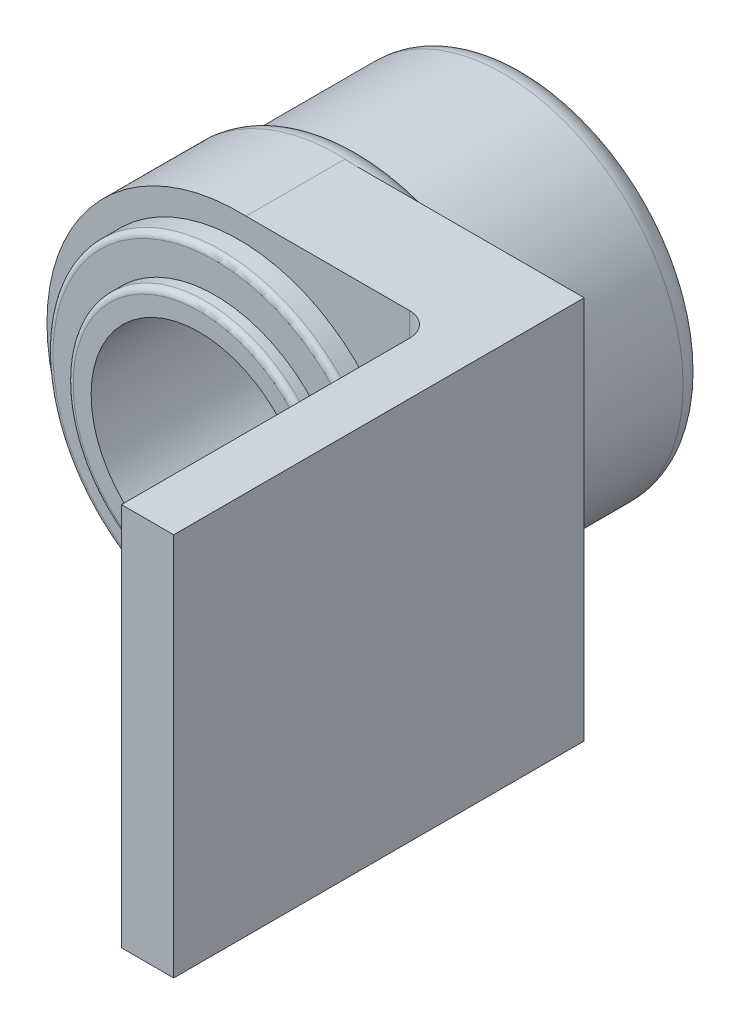
ISO-10303-21;
HEADER;
FILE_DESCRIPTION(('STEP AP214'),'2;1');
FILE_NAME('part.step','',(''),(''),'','','');
FILE_SCHEMA(('AUTOMOTIVE_DESIGN { 1 0 10303 214 1 1 1 1 }'));
ENDSEC;
DATA;
#1=APPLICATION_CONTEXT('core data for automotive mechanical design processes');
#2=APPLICATION_PROTOCOL_DEFINITION('international standard','automotive_design',2000,#1);
#3=PRODUCT_CONTEXT('',#1,'mechanical');
#4=PRODUCT('Part','Part','',(#3));
#5=PRODUCT_RELATED_PRODUCT_CATEGORY('part','',(#4));
#6=PRODUCT_DEFINITION_FORMATION('','',#4);
#7=PRODUCT_DEFINITION_CONTEXT('part definition',#1,'design');
#8=PRODUCT_DEFINITION('design','',#6,#7);
#9=PRODUCT_DEFINITION_SHAPE('','',#8);
#10=(LENGTH_UNIT() NAMED_UNIT(*) SI_UNIT(.MILLI.,.METRE.));
#11=(NAMED_UNIT(*) PLANE_ANGLE_UNIT() SI_UNIT($,.RADIAN.));
#12=(NAMED_UNIT(*) SI_UNIT($,.STERADIAN.) SOLID_ANGLE_UNIT());
#13=UNCERTAINTY_MEASURE_WITH_UNIT(LENGTH_MEASURE(1.E-05),#10,'distance_accuracy_value','');
#14=(GEOMETRIC_REPRESENTATION_CONTEXT(3) GLOBAL_UNCERTAINTY_ASSIGNED_CONTEXT((#13)) GLOBAL_UNIT_ASSIGNED_CONTEXT((#10,
#11,#12)) REPRESENTATION_CONTEXT('',''));
#15=CARTESIAN_POINT('',(0.,0.,0.));
#16=DIRECTION('',(0.,0.,1.));
#17=DIRECTION('',(1.,0.,0.));
#18=AXIS2_PLACEMENT_3D('',#15,#16,#17);
#19=CARTESIAN_POINT('',(0.,0.,30.48));
#20=DIRECTION('',(0.,0.,1.));
#21=DIRECTION('',(1.,0.,0.));
#22=AXIS2_PLACEMENT_3D('',#19,#20,#21);
#23=PLANE('',#22);
#24=CARTESIAN_POINT('',(0.,0.,30.48));
#25=DIRECTION('',(0.,0.,1.));
#26=DIRECTION('',(1.,0.,0.));
#27=AXIS2_PLACEMENT_3D('',#24,#25,#26);
#28=CIRCLE('',#27,17.78);
#29=CARTESIAN_POINT('',(17.78,0.,30.48));
#30=VERTEX_POINT('',#29);
#31=EDGE_CURVE('E178',#30,#30,#28,.T.);
#32=ORIENTED_EDGE('',*,*,#31,.F.);
#33=EDGE_LOOP('',(#32));
#34=FACE_BOUND('',#33,.T.);
#35=DIRECTION('',(1.,0.,0.));
#36=VECTOR('',#35,1.);
#37=CARTESIAN_POINT('',(0.711033109642091,-20.307556030133,30.48));
#38=LINE('',#37,#36);
#39=CARTESIAN_POINT('',(0.711033109642091,-20.307556030133,30.48));
#40=VERTEX_POINT('',#39);
#41=CARTESIAN_POINT('',(18.0405418442311,-20.307556030133,30.48));
#42=VERTEX_POINT('',#41);
#43=EDGE_CURVE('E180',#40,#42,#38,.T.);
#44=ORIENTED_EDGE('',*,*,#43,.T.);
#45=DIRECTION('',(0.,-1.,0.));
#46=VECTOR('',#45,1.);
#47=CARTESIAN_POINT('',(18.0405418442311,0.,30.48));
#48=LINE('',#47,#46);
#49=CARTESIAN_POINT('',(18.0405418442311,20.3063824496731,30.48));
#50=VERTEX_POINT('',#49);
#51=EDGE_CURVE('E60',#42,#50,#48,.F.);
#52=ORIENTED_EDGE('',*,*,#51,.T.);
#53=DIRECTION('',(-1.,0.,0.));
#54=VECTOR('',#53,1.);
#55=CARTESIAN_POINT('',(26.1110331096421,20.3063824496731,30.48));
#56=LINE('',#55,#54);
#57=CARTESIAN_POINT('',(0.743795541535241,20.3063824496731,30.48));
#58=VERTEX_POINT('',#57);
#59=EDGE_CURVE('E79',#50,#58,#56,.T.);
#60=ORIENTED_EDGE('',*,*,#59,.T.);
#61=CARTESIAN_POINT('',(0.,0.,30.48));
#62=DIRECTION('',(0.,0.,1.));
#63=DIRECTION('',(1.,0.,0.));
#64=AXIS2_PLACEMENT_3D('',#61,#62,#63);
#65=CIRCLE('',#64,20.32);
#66=EDGE_CURVE('E121',#58,#40,#65,.T.);
#67=ORIENTED_EDGE('',*,*,#66,.T.);
#68=EDGE_LOOP('',(#44,#52,#60,#67));
#69=FACE_BOUND('',#68,.T.);
#70=ADVANCED_FACE('F35',(#34,#69),#23,.T.);
#71=CARTESIAN_POINT('',(0.,0.,17.78));
#72=DIRECTION('',(0.,0.,-1.));
#73=DIRECTION('',(-1.,0.,0.));
#74=AXIS2_PLACEMENT_3D('',#71,#72,#73);
#75=CYLINDRICAL_SURFACE('',#74,19.05);
#76=CARTESIAN_POINT('',(0.,0.,2.54));
#77=DIRECTION('',(0.,0.,1.));
#78=DIRECTION('',(1.,0.,0.));
#79=AXIS2_PLACEMENT_3D('',#76,#77,#78);
#80=CIRCLE('',#79,19.05);
#81=CARTESIAN_POINT('',(19.05,0.,2.54));
#82=VERTEX_POINT('',#81);
#83=EDGE_CURVE('E233',#82,#82,#80,.T.);
#84=ORIENTED_EDGE('',*,*,#83,.T.);
#85=EDGE_LOOP('',(#84));
#86=FACE_BOUND('',#85,.T.);
#87=CARTESIAN_POINT('',(0.,0.,17.78));
#88=DIRECTION('',(0.,0.,1.));
#89=DIRECTION('',(1.,0.,0.));
#90=AXIS2_PLACEMENT_3D('',#87,#88,#89);
#91=CIRCLE('',#90,19.05);
#92=CARTESIAN_POINT('',(19.05,0.,17.78));
#93=VERTEX_POINT('',#92);
#94=EDGE_CURVE('E227',#93,#93,#91,.T.);
#95=ORIENTED_EDGE('',*,*,#94,.F.);
#96=EDGE_LOOP('',(#95));
#97=FACE_BOUND('',#96,.T.);
#98=ADVANCED_FACE('F140',(#86,#97),#75,.T.);
#99=CARTESIAN_POINT('',(0.,0.,0.));
#100=DIRECTION('',(0.,0.,1.));
#101=DIRECTION('',(1.,0.,0.));
#102=AXIS2_PLACEMENT_3D('',#99,#100,#101);
#103=PLANE('',#102);
#104=CARTESIAN_POINT('',(0.,0.,0.));
#105=DIRECTION('',(0.,0.,1.));
#106=DIRECTION('',(1.,0.,0.));
#107=AXIS2_PLACEMENT_3D('',#104,#105,#106);
#108=CIRCLE('',#107,16.51);
#109=CARTESIAN_POINT('',(16.51,0.,0.));
#110=VERTEX_POINT('',#109);
#111=EDGE_CURVE('E236',#110,#110,#108,.F.);
#112=ORIENTED_EDGE('',*,*,#111,.T.);
#113=EDGE_LOOP('',(#112));
#114=FACE_BOUND('',#113,.T.);
#115=CARTESIAN_POINT('',(0.,0.,0.));
#116=DIRECTION('',(0.,0.,1.));
#117=DIRECTION('',(1.,0.,0.));
#118=AXIS2_PLACEMENT_3D('',#115,#116,#117);
#119=CIRCLE('',#118,12.3597045256125);
#120=CARTESIAN_POINT('',(12.3597045256125,0.,0.));
#121=VERTEX_POINT('',#120);
#122=EDGE_CURVE('E230',#121,#121,#119,.T.);
#123=ORIENTED_EDGE('',*,*,#122,.T.);
#124=EDGE_LOOP('',(#123));
#125=FACE_BOUND('',#124,.T.);
#126=ADVANCED_FACE('F136',(#114,#125),#103,.F.);
#127=CARTESIAN_POINT('',(0.,0.,1.27));
#128=DIRECTION('',(0.,0.,-1.));
#129=DIRECTION('',(-1.,0.,0.));
#130=AXIS2_PLACEMENT_3D('',#127,#128,#129);
#131=PLANE('',#130);
#132=CARTESIAN_POINT('',(0.,0.,1.27));
#133=DIRECTION('',(0.,0.,-1.));
#134=DIRECTION('',(-1.,0.,0.));
#135=AXIS2_PLACEMENT_3D('',#132,#133,#134);
#136=CIRCLE('',#135,10.16);
#137=CARTESIAN_POINT('',(-10.16,0.,1.27));
#138=VERTEX_POINT('',#137);
#139=EDGE_CURVE('E224',#138,#138,#136,.T.);
#140=ORIENTED_EDGE('',*,*,#139,.T.);
#141=EDGE_LOOP('',(#140));
#142=FACE_BOUND('',#141,.T.);
#143=ADVANCED_FACE('F132',(#142),#131,.T.);
#144=CARTESIAN_POINT('',(0.,0.,2.54));
#145=DIRECTION('',(0.,0.,1.));
#146=DIRECTION('',(1.,0.,0.));
#147=AXIS2_PLACEMENT_3D('',#144,#145,#146);
#148=TOROIDAL_SURFACE('',#147,12.3597045256125,2.54);
#149=ORIENTED_EDGE('',*,*,#122,.F.);
#150=EDGE_LOOP('',(#149));
#151=FACE_BOUND('',#150,.T.);
#152=ORIENTED_EDGE('',*,*,#139,.F.);
#153=EDGE_LOOP('',(#152));
#154=FACE_BOUND('',#153,.T.);
#155=ADVANCED_FACE('F135',(#151,#154),#148,.T.);
#156=CARTESIAN_POINT('',(0.,0.,2.54));
#157=DIRECTION('',(0.,0.,1.));
#158=DIRECTION('',(1.,0.,0.));
#159=AXIS2_PLACEMENT_3D('',#156,#157,#158);
#160=TOROIDAL_SURFACE('',#159,16.51,2.54);
#161=ORIENTED_EDGE('',*,*,#111,.F.);
#162=EDGE_LOOP('',(#161));
#163=FACE_BOUND('',#162,.T.);
#164=ORIENTED_EDGE('',*,*,#83,.F.);
#165=EDGE_LOOP('',(#164));
#166=FACE_BOUND('',#165,.T.);
#167=ADVANCED_FACE('F129',(#163,#166),#160,.T.);
#168=CARTESIAN_POINT('',(0.,0.,30.48));
#169=DIRECTION('',(0.,0.,-1.));
#170=DIRECTION('',(-1.,0.,0.));
#171=AXIS2_PLACEMENT_3D('',#168,#169,#170);
#172=CYLINDRICAL_SURFACE('',#171,20.32);
#173=CARTESIAN_POINT('',(0.,0.,20.066));
#174=DIRECTION('',(0.,0.,-1.));
#175=DIRECTION('',(-1.,0.,0.));
#176=AXIS2_PLACEMENT_3D('',#173,#174,#175);
#177=CIRCLE('',#176,20.32);
#178=CARTESIAN_POINT('',(0.743795541535204,20.3063824496731,20.066));
#179=VERTEX_POINT('',#178);
#180=CARTESIAN_POINT('',(20.315186875558,-0.442246776307828,20.066));
#181=VERTEX_POINT('',#180);
#182=EDGE_CURVE('E107',#179,#181,#177,.T.);
#183=ORIENTED_EDGE('',*,*,#182,.T.);
#184=DIRECTION('',(0.,0.,1.));
#185=VECTOR('',#184,1.);
#186=CARTESIAN_POINT('',(20.315186875558,-0.442246776307828,20.066));
#187=LINE('',#186,#185);
#188=CARTESIAN_POINT('',(20.315186875558,-0.442246776307828,31.889694739701));
#189=VERTEX_POINT('',#188);
#190=EDGE_CURVE('E209',#181,#189,#187,.T.);
#191=ORIENTED_EDGE('',*,*,#190,.T.);
#192=CARTESIAN_POINT('',(20.196745768736,-2.23469468899993,31.6774708062952));
#193=CARTESIAN_POINT('',(20.2130972578753,-2.0869078589941,31.7037217129536));
#194=CARTESIAN_POINT('',(20.2278590378379,-1.93865722935699,31.728510658331));
#195=CARTESIAN_POINT('',(20.2541376364174,-1.64150272376683,31.7740960102462));
#196=CARTESIAN_POINT('',(20.2656595278468,-1.49260024394653,31.7948986418478));
#197=CARTESIAN_POINT('',(20.2854456849002,-1.19393395859893,31.8315339621637));
#198=CARTESIAN_POINT('',(20.2937095843895,-1.04417005818251,31.84736609225));
#199=CARTESIAN_POINT('',(20.3069419062212,-0.743761340839121,31.8731712969486));
#200=CARTESIAN_POINT('',(20.3119051220306,-0.593115508512003,31.8831351120013));
#201=CARTESIAN_POINT('',(20.315186875558,-0.442246776307825,31.889694739701));
#202=B_SPLINE_CURVE_WITH_KNOTS('',3,(#192,#193,#194,#195,#196,#197,#198,#199,#200,#201),
.UNSPECIFIED.,.F.,.F.,(4,2,2,2,4),(0.,0.452989463499388,0.905265664490273,1.35759267800912,
1.81063151511252),.UNSPECIFIED.);
#203=CARTESIAN_POINT('',(20.196745768736,-2.23469468899993,31.6774708062952));
#204=VERTEX_POINT('',#203);
#205=EDGE_CURVE('E115',#204,#189,#202,.T.);
#206=ORIENTED_EDGE('',*,*,#205,.F.);
#207=DIRECTION('',(0.,0.,1.));
#208=VECTOR('',#207,1.);
#209=CARTESIAN_POINT('',(20.196745768736,-2.23469468899993,20.066));
#210=LINE('',#209,#208);
#211=CARTESIAN_POINT('',(20.196745768736,-2.23469468899993,20.066));
#212=VERTEX_POINT('',#211);
#213=EDGE_CURVE('E198',#204,#212,#210,.F.);
#214=ORIENTED_EDGE('',*,*,#213,.T.);
#215=CARTESIAN_POINT('',(0.711033109642091,-20.307556030133,20.066));
#216=VERTEX_POINT('',#215);
#217=EDGE_CURVE('E111',#212,#216,#177,.T.);
#218=ORIENTED_EDGE('',*,*,#217,.T.);
#219=DIRECTION('',(0.,0.,1.));
#220=VECTOR('',#219,1.);
#221=CARTESIAN_POINT('',(0.711033109642091,-20.307556030133,20.066));
#222=LINE('',#221,#220);
#223=EDGE_CURVE('E205',#216,#40,#222,.T.);
#224=ORIENTED_EDGE('',*,*,#223,.T.);
#225=ORIENTED_EDGE('',*,*,#66,.F.);
#226=DIRECTION('',(0.,0.,1.));
#227=VECTOR('',#226,1.);
#228=CARTESIAN_POINT('',(0.743795541535204,20.3063824496731,20.066));
#229=LINE('',#228,#227);
#230=EDGE_CURVE('E196',#179,#58,#229,.T.);
#231=ORIENTED_EDGE('',*,*,#230,.F.);
#232=EDGE_LOOP('',(#183,#191,#206,#214,#218,#224,#225,#231));
#233=FACE_BOUND('',#232,.T.);
#234=CARTESIAN_POINT('',(0.,0.,19.9797045256125));
#235=DIRECTION('',(0.,0.,-1.));
#236=DIRECTION('',(-1.,0.,0.));
#237=AXIS2_PLACEMENT_3D('',#234,#235,#236);
#238=CIRCLE('',#237,20.32);
#239=CARTESIAN_POINT('',(-20.32,0.,19.9797045256125));
#240=VERTEX_POINT('',#239);
#241=EDGE_CURVE('E222',#240,#240,#238,.F.);
#242=ORIENTED_EDGE('',*,*,#241,.T.);
#243=EDGE_LOOP('',(#242));
#244=FACE_BOUND('',#243,.T.);
#245=ADVANCED_FACE('F123',(#233,#244),#172,.T.);
#246=CARTESIAN_POINT('',(0.,0.,19.9797045256125));
#247=DIRECTION('',(0.,0.,-1.));
#248=DIRECTION('',(-1.,0.,0.));
#249=AXIS2_PLACEMENT_3D('',#246,#247,#248);
#250=TOROIDAL_SURFACE('',#249,17.78,2.54);
#251=ORIENTED_EDGE('',*,*,#94,.T.);
#252=EDGE_LOOP('',(#251));
#253=FACE_BOUND('',#252,.T.);
#254=ORIENTED_EDGE('',*,*,#241,.F.);
#255=EDGE_LOOP('',(#254));
#256=FACE_BOUND('',#255,.T.);
#257=ADVANCED_FACE('F128',(#253,#256),#250,.T.);
#258=CARTESIAN_POINT('',(0.,0.,33.02));
#259=DIRECTION('',(0.,0.,-1.));
#260=DIRECTION('',(-1.,0.,0.));
#261=AXIS2_PLACEMENT_3D('',#258,#259,#260);
#262=CYLINDRICAL_SURFACE('',#261,17.78);
#263=CARTESIAN_POINT('',(0.,0.,32.385));
#264=DIRECTION('',(0.,0.,1.));
#265=DIRECTION('',(1.,0.,0.));
#266=AXIS2_PLACEMENT_3D('',#263,#264,#265);
#267=CIRCLE('',#266,17.78);
#268=CARTESIAN_POINT('',(17.78,0.,32.385));
#269=VERTEX_POINT('',#268);
#270=EDGE_CURVE('E248',#269,#269,#267,.F.);
#271=ORIENTED_EDGE('',*,*,#270,.T.);
#272=EDGE_LOOP('',(#271));
#273=FACE_BOUND('',#272,.T.);
#274=ORIENTED_EDGE('',*,*,#31,.T.);
#275=EDGE_LOOP('',(#274));
#276=FACE_BOUND('',#275,.T.);
#277=ADVANCED_FACE('F153',(#273,#276),#262,.T.);
#278=CARTESIAN_POINT('',(0.,0.,33.02));
#279=DIRECTION('',(0.,0.,1.));
#280=DIRECTION('',(1.,0.,0.));
#281=AXIS2_PLACEMENT_3D('',#278,#279,#280);
#282=PLANE('',#281);
#283=CARTESIAN_POINT('',(0.,0.,33.02));
#284=DIRECTION('',(0.,0.,1.));
#285=DIRECTION('',(1.,0.,0.));
#286=AXIS2_PLACEMENT_3D('',#283,#284,#285);
#287=CIRCLE('',#286,17.145);
#288=CARTESIAN_POINT('',(17.145,0.,33.02));
#289=VERTEX_POINT('',#288);
#290=EDGE_CURVE('E246',#289,#289,#287,.T.);
#291=ORIENTED_EDGE('',*,*,#290,.T.);
#292=EDGE_LOOP('',(#291));
#293=FACE_BOUND('',#292,.T.);
#294=CARTESIAN_POINT('',(0.,0.,33.02));
#295=DIRECTION('',(0.,0.,1.));
#296=DIRECTION('',(1.,0.,0.));
#297=AXIS2_PLACEMENT_3D('',#294,#295,#296);
#298=CIRCLE('',#297,13.97);
#299=CARTESIAN_POINT('',(13.97,0.,33.02));
#300=VERTEX_POINT('',#299);
#301=EDGE_CURVE('E217',#300,#300,#298,.T.);
#302=ORIENTED_EDGE('',*,*,#301,.F.);
#303=EDGE_LOOP('',(#302));
#304=FACE_BOUND('',#303,.T.);
#305=ADVANCED_FACE('F334',(#293,#304),#282,.T.);
#306=CARTESIAN_POINT('',(0.,0.,34.6964));
#307=DIRECTION('',(0.,0.,-1.));
#308=DIRECTION('',(-1.,0.,0.));
#309=AXIS2_PLACEMENT_3D('',#306,#307,#308);
#310=CYLINDRICAL_SURFACE('',#309,13.97);
#311=CARTESIAN_POINT('',(0.,0.,34.0614));
#312=DIRECTION('',(0.,0.,1.));
#313=DIRECTION('',(1.,0.,0.));
#314=AXIS2_PLACEMENT_3D('',#311,#312,#313);
#315=CIRCLE('',#314,13.97);
#316=CARTESIAN_POINT('',(13.97,0.,34.0614));
#317=VERTEX_POINT('',#316);
#318=EDGE_CURVE('E243',#317,#317,#315,.F.);
#319=ORIENTED_EDGE('',*,*,#318,.T.);
#320=EDGE_LOOP('',(#319));
#321=FACE_BOUND('',#320,.T.);
#322=ORIENTED_EDGE('',*,*,#301,.T.);
#323=EDGE_LOOP('',(#322));
#324=FACE_BOUND('',#323,.T.);
#325=ADVANCED_FACE('F330',(#321,#324),#310,.T.);
#326=CARTESIAN_POINT('',(0.,0.,34.6964));
#327=DIRECTION('',(0.,0.,1.));
#328=DIRECTION('',(1.,0.,0.));
#329=AXIS2_PLACEMENT_3D('',#326,#327,#328);
#330=PLANE('',#329);
#331=CARTESIAN_POINT('',(0.,0.,34.6964));
#332=DIRECTION('',(0.,0.,1.));
#333=DIRECTION('',(1.,0.,0.));
#334=AXIS2_PLACEMENT_3D('',#331,#332,#333);
#335=CIRCLE('',#334,11.43);
#336=CARTESIAN_POINT('',(11.43,0.,34.6964));
#337=VERTEX_POINT('',#336);
#338=EDGE_CURVE('E212',#337,#337,#335,.T.);
#339=ORIENTED_EDGE('',*,*,#338,.F.);
#340=EDGE_LOOP('',(#339));
#341=FACE_BOUND('',#340,.T.);
#342=CARTESIAN_POINT('',(0.,0.,34.6964));
#343=DIRECTION('',(0.,0.,1.));
#344=DIRECTION('',(1.,0.,0.));
#345=AXIS2_PLACEMENT_3D('',#342,#343,#344);
#346=CIRCLE('',#345,13.335);
#347=CARTESIAN_POINT('',(13.335,0.,34.6964));
#348=VERTEX_POINT('',#347);
#349=EDGE_CURVE('E220',#348,#348,#346,.T.);
#350=ORIENTED_EDGE('',*,*,#349,.T.);
#351=EDGE_LOOP('',(#350));
#352=FACE_BOUND('',#351,.T.);
#353=ADVANCED_FACE('F158',(#341,#352),#330,.T.);
#354=CARTESIAN_POINT('',(0.,0.,34.0614));
#355=DIRECTION('',(0.,0.,1.));
#356=DIRECTION('',(1.,0.,0.));
#357=AXIS2_PLACEMENT_3D('',#354,#355,#356);
#358=TOROIDAL_SURFACE('',#357,13.335,0.635);
#359=ORIENTED_EDGE('',*,*,#318,.F.);
#360=EDGE_LOOP('',(#359));
#361=FACE_BOUND('',#360,.T.);
#362=ORIENTED_EDGE('',*,*,#349,.F.);
#363=EDGE_LOOP('',(#362));
#364=FACE_BOUND('',#363,.T.);
#365=ADVANCED_FACE('F155',(#361,#364),#358,.T.);
#366=CARTESIAN_POINT('',(0.,0.,32.385));
#367=DIRECTION('',(0.,0.,1.));
#368=DIRECTION('',(1.,0.,0.));
#369=AXIS2_PLACEMENT_3D('',#366,#367,#368);
#370=TOROIDAL_SURFACE('',#369,17.145,0.635);
#371=ORIENTED_EDGE('',*,*,#270,.F.);
#372=EDGE_LOOP('',(#371));
#373=FACE_BOUND('',#372,.T.);
#374=ORIENTED_EDGE('',*,*,#290,.F.);
#375=EDGE_LOOP('',(#374));
#376=FACE_BOUND('',#375,.T.);
#377=ADVANCED_FACE('F157',(#373,#376),#370,.T.);
#378=CARTESIAN_POINT('',(0.,0.,1.67639999999999));
#379=DIRECTION('',(0.,0.,1.));
#380=DIRECTION('',(1.,0.,0.));
#381=AXIS2_PLACEMENT_3D('',#378,#379,#380);
#382=CYLINDRICAL_SURFACE('',#381,11.43);
#383=CARTESIAN_POINT('',(0.,0.,1.67639999999999));
#384=DIRECTION('',(0.,0.,1.));
#385=DIRECTION('',(1.,0.,0.));
#386=AXIS2_PLACEMENT_3D('',#383,#384,#385);
#387=CIRCLE('',#386,11.43);
#388=CARTESIAN_POINT('',(11.43,0.,1.67639999999999));
#389=VERTEX_POINT('',#388);
#390=EDGE_CURVE('E122',#389,#389,#387,.T.);
#391=ORIENTED_EDGE('',*,*,#390,.F.);
#392=EDGE_LOOP('',(#391));
#393=FACE_BOUND('',#392,.T.);
#394=ORIENTED_EDGE('',*,*,#338,.T.);
#395=EDGE_LOOP('',(#394));
#396=FACE_BOUND('',#395,.T.);
#397=ADVANCED_FACE('F161',(#393,#396),#382,.F.);
#398=CARTESIAN_POINT('',(0.,0.,1.67639999999999));
#399=DIRECTION('',(0.,0.,1.));
#400=DIRECTION('',(1.,0.,0.));
#401=AXIS2_PLACEMENT_3D('',#398,#399,#400);
#402=PLANE('',#401);
#403=ORIENTED_EDGE('',*,*,#390,.T.);
#404=EDGE_LOOP('',(#403));
#405=FACE_BOUND('',#404,.T.);
#406=ADVANCED_FACE('F166',(#405),#402,.T.);
#407=CARTESIAN_POINT('',(0.743795541535204,19.0363824496731,20.066));
#408=CARTESIAN_POINT('',(10.7002578877914,19.3989930923625,20.066));
#409=CARTESIAN_POINT('',(29.9218441259048,-0.322882604593407,20.066));
#410=CARTESIAN_POINT('',(10.7190569953248,-19.8806592697991,20.066));
#411=CARTESIAN_POINT('',(0.711033109642091,-19.037556030133,20.066));
#412=B_SPLINE_CURVE_WITH_KNOTS('',3,(#407,#408,#409,#410,#411),.UNSPECIFIED.,.F.,.F.,(4,1,4),
(0.,0.50408332701848,1.),.UNSPECIFIED.);
#413=DIRECTION('',(0.,0.,1.));
#414=VECTOR('',#413,1.);
#415=SURFACE_OF_LINEAR_EXTRUSION('',#412,#414);
#416=ORIENTED_EDGE('',*,*,#190,.F.);
#417=EDGE_CURVE('E190',#181,#212,#412,.T.);
#418=ORIENTED_EDGE('',*,*,#417,.T.);
#419=ORIENTED_EDGE('',*,*,#213,.F.);
#420=CARTESIAN_POINT('',(20.315186875558,-0.442246776307828,31.889694739701));
#421=CARTESIAN_POINT('',(20.314618849281,-0.51796820021027,31.888559704465));
#422=CARTESIAN_POINT('',(20.3134784527396,-0.593663969658937,31.8862588889282));
#423=CARTESIAN_POINT('',(20.3100729688202,-0.744745085306103,31.879452899267));
#424=CARTESIAN_POINT('',(20.307810652415,-0.820130737211202,31.8749531565587));
#425=CARTESIAN_POINT('',(20.3021824028409,-0.970599041283987,31.8638775859463));
#426=CARTESIAN_POINT('',(20.2988180334656,-1.04568197106682,31.8573047002831));
#427=CARTESIAN_POINT('',(20.2910059781109,-1.19555814096807,31.8422550209405));
#428=CARTESIAN_POINT('',(20.2865588716672,-1.27035151438691,31.8337792459724));
#429=CARTESIAN_POINT('',(20.2766024937664,-1.4196183918388,31.8151164698436));
#430=CARTESIAN_POINT('',(20.2710936895627,-1.49409202190554,31.8049302217154));
#431=CARTESIAN_POINT('',(20.2590271764289,-1.64279677585667,31.7830362970532));
#432=CARTESIAN_POINT('',(20.2524685392776,-1.71702762525935,31.7713272758767));
#433=CARTESIAN_POINT('',(20.2383146332194,-1.86527958719691,31.7465802476641));
#434=CARTESIAN_POINT('',(20.2307178568284,-1.93930023193494,31.7335403151101));
#435=CARTESIAN_POINT('',(20.2144969798152,-2.0871651369226,31.7063136646226));
#436=CARTESIAN_POINT('',(20.2058709527768,-2.1610087939448,31.6921248127564));
#437=CARTESIAN_POINT('',(20.196745768736,-2.23469468899993,31.6774708062952));
#438=B_SPLINE_CURVE_WITH_KNOTS('',3,(#420,#421,#422,#423,#424,#425,#426,#427,#428,#429,#430,
#431,#432,#433,#434,#435,#436,#437),.UNSPECIFIED.,.F.,.F.,(4,2,2,2,2,2,2,2,4),(0.,
0.227179430781845,0.453800536393526,0.680101453664564,0.906281508453477,1.13236224771668,
1.35864399424726,1.58525788739066,1.81230278369995),.UNSPECIFIED.);
#439=EDGE_CURVE('E40',#189,#204,#438,.T.);
#440=ORIENTED_EDGE('',*,*,#439,.F.);
#441=EDGE_LOOP('',(#416,#418,#419,#440));
#442=FACE_BOUND('',#441,.T.);
#443=ADVANCED_FACE('F268',(#442),#415,.T.);
#444=CARTESIAN_POINT('',(26.1110331096421,20.3063824496731,20.066));
#445=DIRECTION('',(0.,1.,0.));
#446=DIRECTION('',(0.,0.,1.));
#447=AXIS2_PLACEMENT_3D('',#444,#445,#446);
#448=PLANE('',#447);
#449=ORIENTED_EDGE('',*,*,#59,.F.);
#450=CARTESIAN_POINT('',(18.0405418442311,20.3063824496731,33.02));
#451=DIRECTION('',(0.,1.,0.));
#452=DIRECTION('',(0.,0.,1.));
#453=AXIS2_PLACEMENT_3D('',#450,#451,#452);
#454=CIRCLE('',#453,2.54);
#455=CARTESIAN_POINT('',(20.5805418442311,20.3063824496731,33.02));
#456=VERTEX_POINT('',#455);
#457=EDGE_CURVE('E11',#50,#456,#454,.F.);
#458=ORIENTED_EDGE('',*,*,#457,.T.);
#459=DIRECTION('',(0.,0.,-1.));
#460=VECTOR('',#459,1.);
#461=CARTESIAN_POINT('',(20.5805418442311,20.3063824496731,63.5));
#462=LINE('',#461,#460);
#463=CARTESIAN_POINT('',(20.5805418442311,20.3063824496731,63.5));
#464=VERTEX_POINT('',#463);
#465=EDGE_CURVE('E92',#464,#456,#462,.T.);
#466=ORIENTED_EDGE('',*,*,#465,.F.);
#467=DIRECTION('',(-1.,0.,0.));
#468=VECTOR('',#467,1.);
#469=CARTESIAN_POINT('',(20.5805418442311,20.3063824496731,63.5));
#470=LINE('',#469,#468);
#471=CARTESIAN_POINT('',(26.1110331096421,20.3063824496731,63.5));
#472=VERTEX_POINT('',#471);
#473=EDGE_CURVE('E105',#472,#464,#470,.T.);
#474=ORIENTED_EDGE('',*,*,#473,.F.);
#475=DIRECTION('',(0.,0.,1.));
#476=VECTOR('',#475,1.);
#477=CARTESIAN_POINT('',(26.1110331096421,20.3063824496731,20.066));
#478=LINE('',#477,#476);
#479=CARTESIAN_POINT('',(26.1110331096421,20.3063824496731,20.066));
#480=VERTEX_POINT('',#479);
#481=EDGE_CURVE('E199',#480,#472,#478,.T.);
#482=ORIENTED_EDGE('',*,*,#481,.F.);
#483=DIRECTION('',(-1.,0.,0.));
#484=VECTOR('',#483,1.);
#485=CARTESIAN_POINT('',(26.1110331096421,20.3063824496731,20.066));
#486=LINE('',#485,#484);
#487=EDGE_CURVE('E269',#480,#179,#486,.T.);
#488=ORIENTED_EDGE('',*,*,#487,.T.);
#489=ORIENTED_EDGE('',*,*,#230,.T.);
#490=EDGE_LOOP('',(#449,#458,#466,#474,#482,#488,#489));
#491=FACE_BOUND('',#490,.T.);
#492=ADVANCED_FACE('F89',(#491),#448,.T.);
#493=CARTESIAN_POINT('',(26.1110331096421,-20.307556030133,20.066));
#494=DIRECTION('',(1.,0.,0.));
#495=DIRECTION('',(0.,1.,0.));
#496=AXIS2_PLACEMENT_3D('',#493,#494,#495);
#497=PLANE('',#496);
#498=ORIENTED_EDGE('',*,*,#481,.T.);
#499=DIRECTION('',(0.,1.,0.));
#500=VECTOR('',#499,1.);
#501=CARTESIAN_POINT('',(26.1110331096421,-20.307556030133,63.5));
#502=LINE('',#501,#500);
#503=CARTESIAN_POINT('',(26.1110331096421,-20.307556030133,63.5));
#504=VERTEX_POINT('',#503);
#505=EDGE_CURVE('E282',#504,#472,#502,.T.);
#506=ORIENTED_EDGE('',*,*,#505,.F.);
#507=DIRECTION('',(0.,0.,1.));
#508=VECTOR('',#507,1.);
#509=CARTESIAN_POINT('',(26.1110331096421,-20.307556030133,20.066));
#510=LINE('',#509,#508);
#511=CARTESIAN_POINT('',(26.1110331096421,-20.307556030133,20.066));
#512=VERTEX_POINT('',#511);
#513=EDGE_CURVE('E202',#512,#504,#510,.T.);
#514=ORIENTED_EDGE('',*,*,#513,.F.);
#515=DIRECTION('',(0.,1.,0.));
#516=VECTOR('',#515,1.);
#517=CARTESIAN_POINT('',(26.1110331096421,-20.307556030133,20.066));
#518=LINE('',#517,#516);
#519=EDGE_CURVE('E271',#512,#480,#518,.T.);
#520=ORIENTED_EDGE('',*,*,#519,.T.);
#521=EDGE_LOOP('',(#498,#506,#514,#520));
#522=FACE_BOUND('',#521,.T.);
#523=ADVANCED_FACE('F300',(#522),#497,.T.);
#524=CARTESIAN_POINT('',(0.711033109642091,-20.307556030133,20.066));
#525=DIRECTION('',(0.,-1.,0.));
#526=DIRECTION('',(0.,0.,-1.));
#527=AXIS2_PLACEMENT_3D('',#524,#525,#526);
#528=PLANE('',#527);
#529=ORIENTED_EDGE('',*,*,#43,.F.);
#530=ORIENTED_EDGE('',*,*,#223,.F.);
#531=DIRECTION('',(1.,0.,0.));
#532=VECTOR('',#531,1.);
#533=CARTESIAN_POINT('',(0.711033109642091,-20.307556030133,20.066));
#534=LINE('',#533,#532);
#535=EDGE_CURVE('E265',#216,#512,#534,.T.);
#536=ORIENTED_EDGE('',*,*,#535,.T.);
#537=ORIENTED_EDGE('',*,*,#513,.T.);
#538=DIRECTION('',(1.,0.,0.));
#539=VECTOR('',#538,1.);
#540=CARTESIAN_POINT('',(20.5805418442311,-20.307556030133,63.5));
#541=LINE('',#540,#539);
#542=CARTESIAN_POINT('',(20.5805418442311,-20.307556030133,63.5));
#543=VERTEX_POINT('',#542);
#544=EDGE_CURVE('E285',#543,#504,#541,.T.);
#545=ORIENTED_EDGE('',*,*,#544,.F.);
#546=DIRECTION('',(0.,0.,-1.));
#547=VECTOR('',#546,1.);
#548=CARTESIAN_POINT('',(20.5805418442311,-20.307556030133,63.5));
#549=LINE('',#548,#547);
#550=CARTESIAN_POINT('',(20.5805418442311,-20.307556030133,33.02));
#551=VERTEX_POINT('',#550);
#552=EDGE_CURVE('E104',#543,#551,#549,.T.);
#553=ORIENTED_EDGE('',*,*,#552,.T.);
#554=CARTESIAN_POINT('',(18.0405418442311,-20.307556030133,33.02));
#555=DIRECTION('',(0.,-1.,0.));
#556=DIRECTION('',(0.,0.,-1.));
#557=AXIS2_PLACEMENT_3D('',#554,#555,#556);
#558=CIRCLE('',#557,2.54);
#559=EDGE_CURVE('E51',#551,#42,#558,.F.);
#560=ORIENTED_EDGE('',*,*,#559,.T.);
#561=EDGE_LOOP('',(#529,#530,#536,#537,#545,#553,#560));
#562=FACE_BOUND('',#561,.T.);
#563=ADVANCED_FACE('F295',(#562),#528,.T.);
#564=CARTESIAN_POINT('',(20.3150767789412,-0.201664776845797,20.066));
#565=DIRECTION('',(0.,0.,-1.));
#566=DIRECTION('',(-1.,0.,0.));
#567=AXIS2_PLACEMENT_3D('',#564,#565,#566);
#568=PLANE('',#567);
#569=ORIENTED_EDGE('',*,*,#182,.F.);
#570=ORIENTED_EDGE('',*,*,#487,.F.);
#571=ORIENTED_EDGE('',*,*,#519,.F.);
#572=ORIENTED_EDGE('',*,*,#535,.F.);
#573=ORIENTED_EDGE('',*,*,#217,.F.);
#574=ORIENTED_EDGE('',*,*,#417,.F.);
#575=EDGE_LOOP('',(#569,#570,#571,#572,#573,#574));
#576=FACE_BOUND('',#575,.T.);
#577=ADVANCED_FACE('F262',(#576),#568,.T.);
#578=CARTESIAN_POINT('',(20.5805418442311,-20.307556030133,63.5));
#579=DIRECTION('',(1.,0.,0.));
#580=DIRECTION('',(0.,0.,-1.));
#581=AXIS2_PLACEMENT_3D('',#578,#579,#580);
#582=PLANE('',#581);
#583=ORIENTED_EDGE('',*,*,#465,.T.);
#584=DIRECTION('',(0.,-1.,0.));
#585=VECTOR('',#584,1.);
#586=CARTESIAN_POINT('',(20.5805418442311,-20.307556030133,33.02));
#587=LINE('',#586,#585);
#588=EDGE_CURVE('E100',#456,#551,#587,.T.);
#589=ORIENTED_EDGE('',*,*,#588,.T.);
#590=ORIENTED_EDGE('',*,*,#552,.F.);
#591=DIRECTION('',(0.,-1.,0.));
#592=VECTOR('',#591,1.);
#593=CARTESIAN_POINT('',(20.5805418442311,-20.307556030133,63.5));
#594=LINE('',#593,#592);
#595=EDGE_CURVE('E103',#464,#543,#594,.T.);
#596=ORIENTED_EDGE('',*,*,#595,.F.);
#597=EDGE_LOOP('',(#583,#589,#590,#596));
#598=FACE_BOUND('',#597,.T.);
#599=ADVANCED_FACE('F98',(#598),#582,.F.);
#600=CARTESIAN_POINT('',(0.,0.,63.5));
#601=DIRECTION('',(0.,0.,-1.));
#602=DIRECTION('',(-1.,0.,0.));
#603=AXIS2_PLACEMENT_3D('',#600,#601,#602);
#604=PLANE('',#603);
#605=ORIENTED_EDGE('',*,*,#595,.T.);
#606=ORIENTED_EDGE('',*,*,#544,.T.);
#607=ORIENTED_EDGE('',*,*,#505,.T.);
#608=ORIENTED_EDGE('',*,*,#473,.T.);
#609=EDGE_LOOP('',(#605,#606,#607,#608));
#610=FACE_BOUND('',#609,.T.);
#611=ADVANCED_FACE('F290',(#610),#604,.F.);
#612=CARTESIAN_POINT('',(18.0405418442311,-20.307556030133,33.02));
#613=DIRECTION('',(0.,-1.,0.));
#614=DIRECTION('',(0.,0.,-1.));
#615=AXIS2_PLACEMENT_3D('',#612,#613,#614);
#616=CYLINDRICAL_SURFACE('',#615,2.54);
#617=ORIENTED_EDGE('',*,*,#457,.F.);
#618=ORIENTED_EDGE('',*,*,#51,.F.);
#619=ORIENTED_EDGE('',*,*,#559,.F.);
#620=ORIENTED_EDGE('',*,*,#588,.F.);
#621=EDGE_LOOP('',(#617,#618,#619,#620));
#622=FACE_BOUND('',#621,.T.);
#623=ORIENTED_EDGE('',*,*,#205,.T.);
#624=ORIENTED_EDGE('',*,*,#439,.T.);
#625=EDGE_LOOP('',(#623,#624));
#626=FACE_BOUND('',#625,.T.);
#627=ADVANCED_FACE('F37',(#622,#626),#616,.F.);
#628=CLOSED_SHELL('',(#70,#98,#126,#143,#155,#167,#245,#257,#277,#305,#325,#353,#365,#377,#397,
#406,#443,#492,#523,#563,#577,#599,#611,#627));
#629=MANIFOLD_SOLID_BREP('B2',#628);
#630=ADVANCED_BREP_SHAPE_REPRESENTATION('',(#18,#629),#14);
#631=SHAPE_DEFINITION_REPRESENTATION(#9,#630);
ENDSEC;
END-ISO-10303-21;
